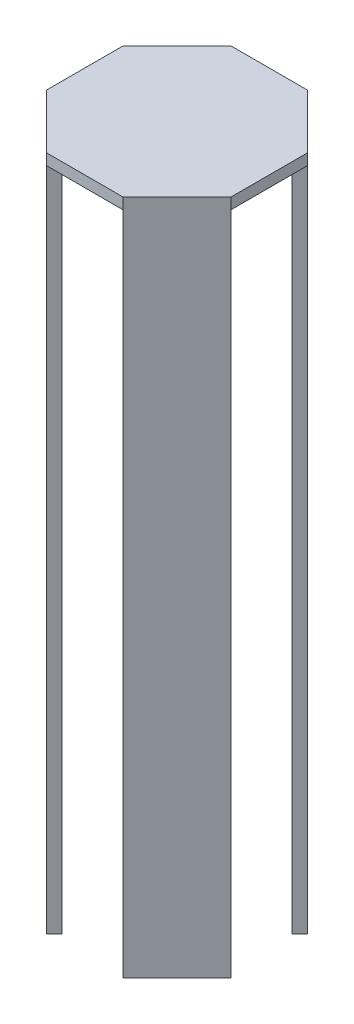
ISO-10303-21;
HEADER;
FILE_DESCRIPTION(('STEP AP214'),'2;1');
FILE_NAME('part.step','',(''),(''),'','','');
FILE_SCHEMA(('AUTOMOTIVE_DESIGN { 1 0 10303 214 1 1 1 1 }'));
ENDSEC;
DATA;
#1=APPLICATION_CONTEXT('core data for automotive mechanical design processes');
#2=APPLICATION_PROTOCOL_DEFINITION('international standard','automotive_design',2000,#1);
#3=PRODUCT_CONTEXT('',#1,'mechanical');
#4=PRODUCT('Part','Part','',(#3));
#5=PRODUCT_RELATED_PRODUCT_CATEGORY('part','',(#4));
#6=PRODUCT_DEFINITION_FORMATION('','',#4);
#7=PRODUCT_DEFINITION_CONTEXT('part definition',#1,'design');
#8=PRODUCT_DEFINITION('design','',#6,#7);
#9=PRODUCT_DEFINITION_SHAPE('','',#8);
#10=(LENGTH_UNIT() NAMED_UNIT(*) SI_UNIT(.MILLI.,.METRE.));
#11=(NAMED_UNIT(*) PLANE_ANGLE_UNIT() SI_UNIT($,.RADIAN.));
#12=(NAMED_UNIT(*) SI_UNIT($,.STERADIAN.) SOLID_ANGLE_UNIT());
#13=UNCERTAINTY_MEASURE_WITH_UNIT(LENGTH_MEASURE(1.E-05),#10,'distance_accuracy_value','');
#14=(GEOMETRIC_REPRESENTATION_CONTEXT(3) GLOBAL_UNCERTAINTY_ASSIGNED_CONTEXT((#13)) GLOBAL_UNIT_ASSIGNED_CONTEXT((#10,
#11,#12)) REPRESENTATION_CONTEXT('',''));
#15=CARTESIAN_POINT('',(0.,0.,0.));
#16=DIRECTION('',(0.,0.,1.));
#17=DIRECTION('',(1.,0.,0.));
#18=AXIS2_PLACEMENT_3D('',#15,#16,#17);
#19=CARTESIAN_POINT('',(0.,180.,0.));
#20=DIRECTION('',(0.,-1.,0.));
#21=DIRECTION('',(0.,0.,-1.));
#22=AXIS2_PLACEMENT_3D('',#19,#20,#21);
#23=PLANE('',#22);
#24=DIRECTION('',(-0.707106781186541,0.,-0.707106781186554));
#25=VECTOR('',#24,1.);
#26=CARTESIAN_POINT('',(-22.8786796564405,180.,8.23401871576749));
#27=LINE('',#26,#25);
#28=CARTESIAN_POINT('',(-8.23401871576796,180.,22.8786796564403));
#29=VERTEX_POINT('',#28);
#30=CARTESIAN_POINT('',(-22.8786796564405,180.,8.23401871576749));
#31=VERTEX_POINT('',#30);
#32=EDGE_CURVE('E193',#29,#31,#27,.T.);
#33=ORIENTED_EDGE('',*,*,#32,.T.);
#34=DIRECTION('',(-0.707106781186554,0.,0.707106781186541));
#35=VECTOR('',#34,1.);
#36=CARTESIAN_POINT('',(-25.0000000000001,180.,10.3553390593271));
#37=LINE('',#36,#35);
#38=CARTESIAN_POINT('',(-25.0000000000001,180.,10.3553390593271));
#39=VERTEX_POINT('',#38);
#40=EDGE_CURVE('E181',#31,#39,#37,.T.);
#41=ORIENTED_EDGE('',*,*,#40,.T.);
#42=DIRECTION('',(0.,0.,1.));
#43=VECTOR('',#42,1.);
#44=CARTESIAN_POINT('',(-25.0000000000001,180.,10.3553390593271));
#45=LINE('',#44,#43);
#46=CARTESIAN_POINT('',(-25.,180.,-10.3553390593274));
#47=VERTEX_POINT('',#46);
#48=EDGE_CURVE('E277',#47,#39,#45,.T.);
#49=ORIENTED_EDGE('',*,*,#48,.F.);
#50=DIRECTION('',(0.707106781186548,0.,0.707106781186547));
#51=VECTOR('',#50,1.);
#52=CARTESIAN_POINT('',(-22.8786796564404,180.,-8.23401871576772));
#53=LINE('',#52,#51);
#54=CARTESIAN_POINT('',(-22.8786796564404,180.,-8.23401871576772));
#55=VERTEX_POINT('',#54);
#56=EDGE_CURVE('E334',#47,#55,#53,.T.);
#57=ORIENTED_EDGE('',*,*,#56,.T.);
#58=DIRECTION('',(0.707106781186547,0.,-0.707106781186548));
#59=VECTOR('',#58,1.);
#60=CARTESIAN_POINT('',(-8.23401871576773,180.,-22.8786796564404));
#61=LINE('',#60,#59);
#62=CARTESIAN_POINT('',(-8.23401871576773,180.,-22.8786796564404));
#63=VERTEX_POINT('',#62);
#64=EDGE_CURVE('E330',#55,#63,#61,.T.);
#65=ORIENTED_EDGE('',*,*,#64,.T.);
#66=DIRECTION('',(-0.707106781186548,0.,-0.707106781186547));
#67=VECTOR('',#66,1.);
#68=CARTESIAN_POINT('',(-10.3553390593274,180.,-25.));
#69=LINE('',#68,#67);
#70=CARTESIAN_POINT('',(-10.3553390593274,180.,-25.));
#71=VERTEX_POINT('',#70);
#72=EDGE_CURVE('E81',#63,#71,#69,.T.);
#73=ORIENTED_EDGE('',*,*,#72,.T.);
#74=DIRECTION('',(-1.,0.,0.));
#75=VECTOR('',#74,1.);
#76=CARTESIAN_POINT('',(-10.3553390593274,180.,-25.));
#77=LINE('',#76,#75);
#78=CARTESIAN_POINT('',(10.3553390593274,180.,-25.));
#79=VERTEX_POINT('',#78);
#80=EDGE_CURVE('E282',#79,#71,#77,.T.);
#81=ORIENTED_EDGE('',*,*,#80,.F.);
#82=DIRECTION('',(-0.707106781186549,0.,0.707106781186546));
#83=VECTOR('',#82,1.);
#84=CARTESIAN_POINT('',(8.2340187157678,180.,-22.8786796564403));
#85=LINE('',#84,#83);
#86=CARTESIAN_POINT('',(8.2340187157678,180.,-22.8786796564403));
#87=VERTEX_POINT('',#86);
#88=EDGE_CURVE('E256',#79,#87,#85,.T.);
#89=ORIENTED_EDGE('',*,*,#88,.T.);
#90=DIRECTION('',(0.707106781186546,0.,0.707106781186549));
#91=VECTOR('',#90,1.);
#92=CARTESIAN_POINT('',(22.8786796564404,180.,-8.23401871576765));
#93=LINE('',#92,#91);
#94=CARTESIAN_POINT('',(22.8786796564404,180.,-8.23401871576765));
#95=VERTEX_POINT('',#94);
#96=EDGE_CURVE('E47',#87,#95,#93,.T.);
#97=ORIENTED_EDGE('',*,*,#96,.T.);
#98=DIRECTION('',(0.70710678118655,0.,-0.707106781186545));
#99=VECTOR('',#98,1.);
#100=CARTESIAN_POINT('',(25.0000000000001,180.,-10.3553390593273));
#101=LINE('',#100,#99);
#102=CARTESIAN_POINT('',(25.0000000000001,180.,-10.3553390593273));
#103=VERTEX_POINT('',#102);
#104=EDGE_CURVE('E252',#95,#103,#101,.T.);
#105=ORIENTED_EDGE('',*,*,#104,.T.);
#106=DIRECTION('',(0.,0.,-1.));
#107=VECTOR('',#106,1.);
#108=CARTESIAN_POINT('',(25.0000000000001,180.,-10.3553390593273));
#109=LINE('',#108,#107);
#110=CARTESIAN_POINT('',(24.9999999999999,180.,10.3553390593275));
#111=VERTEX_POINT('',#110);
#112=EDGE_CURVE('E301',#111,#103,#109,.T.);
#113=ORIENTED_EDGE('',*,*,#112,.F.);
#114=DIRECTION('',(-0.707106781186544,0.,-0.707106781186552));
#115=VECTOR('',#114,1.);
#116=CARTESIAN_POINT('',(22.8786796564403,180.,8.23401871576788));
#117=LINE('',#116,#115);
#118=CARTESIAN_POINT('',(22.8786796564403,180.,8.23401871576788));
#119=VERTEX_POINT('',#118);
#120=EDGE_CURVE('E228',#111,#119,#117,.T.);
#121=ORIENTED_EDGE('',*,*,#120,.T.);
#122=DIRECTION('',(-0.707106781186551,0.,0.707106781186543));
#123=VECTOR('',#122,1.);
#124=CARTESIAN_POINT('',(8.23401871576757,180.,22.8786796564404));
#125=LINE('',#124,#123);
#126=CARTESIAN_POINT('',(8.23401871576757,180.,22.8786796564404));
#127=VERTEX_POINT('',#126);
#128=EDGE_CURVE('E221',#119,#127,#125,.T.);
#129=ORIENTED_EDGE('',*,*,#128,.T.);
#130=DIRECTION('',(0.707106781186543,0.,0.707106781186552));
#131=VECTOR('',#130,1.);
#132=CARTESIAN_POINT('',(10.3553390593272,180.,25.0000000000001));
#133=LINE('',#132,#131);
#134=CARTESIAN_POINT('',(10.3553390593272,180.,25.0000000000001));
#135=VERTEX_POINT('',#134);
#136=EDGE_CURVE('E224',#127,#135,#133,.T.);
#137=ORIENTED_EDGE('',*,*,#136,.T.);
#138=DIRECTION('',(1.,0.,0.));
#139=VECTOR('',#138,1.);
#140=CARTESIAN_POINT('',(10.3553390593272,180.,25.0000000000001));
#141=LINE('',#140,#139);
#142=CARTESIAN_POINT('',(-10.3553390593276,180.,24.9999999999999));
#143=VERTEX_POINT('',#142);
#144=EDGE_CURVE('E298',#143,#135,#141,.T.);
#145=ORIENTED_EDGE('',*,*,#144,.F.);
#146=DIRECTION('',(0.707106781186554,0.,-0.707106781186541));
#147=VECTOR('',#146,1.);
#148=CARTESIAN_POINT('',(-8.23401871576796,180.,22.8786796564403));
#149=LINE('',#148,#147);
#150=EDGE_CURVE('E192',#143,#29,#149,.T.);
#151=ORIENTED_EDGE('',*,*,#150,.T.);
#152=EDGE_LOOP('',(#33,#41,#49,#57,#65,#73,#81,#89,#97,#105,#113,#121,#129,#137,#145,#151));
#153=FACE_BOUND('',#152,.T.);
#154=ADVANCED_FACE('F32',(#153),#23,.T.);
#155=CARTESIAN_POINT('',(-8.23401871576773,180.,-22.8786796564404));
#156=DIRECTION('',(-0.707106781186548,0.,-0.707106781186547));
#157=DIRECTION('',(-0.707106781186547,0.,0.707106781186548));
#158=AXIS2_PLACEMENT_3D('',#155,#156,#157);
#159=PLANE('',#158);
#160=DIRECTION('',(0.707106781186547,0.,-0.707106781186548));
#161=VECTOR('',#160,1.);
#162=CARTESIAN_POINT('',(-8.23401871576773,0.,-22.8786796564404));
#163=LINE('',#162,#161);
#164=CARTESIAN_POINT('',(-22.8786796564404,0.,-8.23401871576772));
#165=VERTEX_POINT('',#164);
#166=CARTESIAN_POINT('',(-8.23401871576773,0.,-22.8786796564404));
#167=VERTEX_POINT('',#166);
#168=EDGE_CURVE('E329',#165,#167,#163,.T.);
#169=ORIENTED_EDGE('',*,*,#168,.T.);
#170=DIRECTION('',(0.,-1.,0.));
#171=VECTOR('',#170,1.);
#172=CARTESIAN_POINT('',(-8.23401871576773,180.,-22.8786796564404));
#173=LINE('',#172,#171);
#174=EDGE_CURVE('E11',#63,#167,#173,.T.);
#175=ORIENTED_EDGE('',*,*,#174,.F.);
#176=ORIENTED_EDGE('',*,*,#64,.F.);
#177=DIRECTION('',(0.,-1.,0.));
#178=VECTOR('',#177,1.);
#179=CARTESIAN_POINT('',(-22.8786796564404,180.,-8.23401871576772));
#180=LINE('',#179,#178);
#181=EDGE_CURVE('E337',#55,#165,#180,.T.);
#182=ORIENTED_EDGE('',*,*,#181,.T.);
#183=EDGE_LOOP('',(#169,#175,#176,#182));
#184=FACE_BOUND('',#183,.T.);
#185=ADVANCED_FACE('F34',(#184),#159,.F.);
#186=CARTESIAN_POINT('',(-10.3553390593274,180.,-25.));
#187=DIRECTION('',(-0.707106781186547,0.,0.707106781186548));
#188=DIRECTION('',(0.707106781186548,0.,0.707106781186547));
#189=AXIS2_PLACEMENT_3D('',#186,#187,#188);
#190=PLANE('',#189);
#191=DIRECTION('',(-0.707106781186548,0.,-0.707106781186547));
#192=VECTOR('',#191,1.);
#193=CARTESIAN_POINT('',(-10.3553390593274,0.,-25.));
#194=LINE('',#193,#192);
#195=CARTESIAN_POINT('',(-10.3553390593274,0.,-25.));
#196=VERTEX_POINT('',#195);
#197=EDGE_CURVE('E340',#167,#196,#194,.T.);
#198=ORIENTED_EDGE('',*,*,#197,.T.);
#199=DIRECTION('',(0.,-1.,0.));
#200=VECTOR('',#199,1.);
#201=CARTESIAN_POINT('',(-10.3553390593274,180.,-25.));
#202=LINE('',#201,#200);
#203=EDGE_CURVE('E40',#71,#196,#202,.T.);
#204=ORIENTED_EDGE('',*,*,#203,.F.);
#205=ORIENTED_EDGE('',*,*,#72,.F.);
#206=ORIENTED_EDGE('',*,*,#174,.T.);
#207=EDGE_LOOP('',(#198,#204,#205,#206));
#208=FACE_BOUND('',#207,.T.);
#209=ADVANCED_FACE('F400',(#208),#190,.F.);
#210=CARTESIAN_POINT('',(-25.,180.,-10.3553390593274));
#211=DIRECTION('',(0.707106781186548,0.,0.707106781186547));
#212=DIRECTION('',(0.707106781186547,0.,-0.707106781186548));
#213=AXIS2_PLACEMENT_3D('',#210,#211,#212);
#214=PLANE('',#213);
#215=DIRECTION('',(-0.707106781186547,0.,0.707106781186548));
#216=VECTOR('',#215,1.);
#217=CARTESIAN_POINT('',(-25.,0.,-10.3553390593274));
#218=LINE('',#217,#216);
#219=CARTESIAN_POINT('',(-25.,0.,-10.3553390593274));
#220=VERTEX_POINT('',#219);
#221=EDGE_CURVE('E342',#196,#220,#218,.T.);
#222=ORIENTED_EDGE('',*,*,#221,.T.);
#223=DIRECTION('',(0.,-1.,0.));
#224=VECTOR('',#223,1.);
#225=CARTESIAN_POINT('',(-25.,180.,-10.3553390593274));
#226=LINE('',#225,#224);
#227=EDGE_CURVE('E56',#47,#220,#226,.T.);
#228=ORIENTED_EDGE('',*,*,#227,.F.);
#229=DIRECTION('',(0.,-1.,0.));
#230=VECTOR('',#229,1.);
#231=CARTESIAN_POINT('',(-25.,183.,-10.3553390593274));
#232=LINE('',#231,#230);
#233=CARTESIAN_POINT('',(-25.,183.,-10.3553390593274));
#234=VERTEX_POINT('',#233);
#235=EDGE_CURVE('E326',#234,#47,#232,.T.);
#236=ORIENTED_EDGE('',*,*,#235,.F.);
#237=DIRECTION('',(-0.707106781186547,0.,0.707106781186548));
#238=VECTOR('',#237,1.);
#239=CARTESIAN_POINT('',(-25.,183.,-10.3553390593274));
#240=LINE('',#239,#238);
#241=CARTESIAN_POINT('',(-10.3553390593274,183.,-25.));
#242=VERTEX_POINT('',#241);
#243=EDGE_CURVE('E278',#242,#234,#240,.T.);
#244=ORIENTED_EDGE('',*,*,#243,.F.);
#245=DIRECTION('',(0.,-1.,0.));
#246=VECTOR('',#245,1.);
#247=CARTESIAN_POINT('',(-10.3553390593274,183.,-25.));
#248=LINE('',#247,#246);
#249=EDGE_CURVE('E296',#242,#71,#248,.T.);
#250=ORIENTED_EDGE('',*,*,#249,.T.);
#251=ORIENTED_EDGE('',*,*,#203,.T.);
#252=EDGE_LOOP('',(#222,#228,#236,#244,#250,#251));
#253=FACE_BOUND('',#252,.T.);
#254=ADVANCED_FACE('F348',(#253),#214,.F.);
#255=CARTESIAN_POINT('',(-22.8786796564404,180.,-8.23401871576772));
#256=DIRECTION('',(0.707106781186547,0.,-0.707106781186548));
#257=DIRECTION('',(-0.707106781186548,0.,-0.707106781186547));
#258=AXIS2_PLACEMENT_3D('',#255,#256,#257);
#259=PLANE('',#258);
#260=DIRECTION('',(0.707106781186548,0.,0.707106781186547));
#261=VECTOR('',#260,1.);
#262=CARTESIAN_POINT('',(-22.8786796564404,0.,-8.23401871576772));
#263=LINE('',#262,#261);
#264=EDGE_CURVE('E76',#220,#165,#263,.T.);
#265=ORIENTED_EDGE('',*,*,#264,.T.);
#266=ORIENTED_EDGE('',*,*,#181,.F.);
#267=ORIENTED_EDGE('',*,*,#56,.F.);
#268=ORIENTED_EDGE('',*,*,#227,.T.);
#269=EDGE_LOOP('',(#265,#266,#267,#268));
#270=FACE_BOUND('',#269,.T.);
#271=ADVANCED_FACE('F355',(#270),#259,.F.);
#272=CARTESIAN_POINT('',(0.,0.,0.));
#273=DIRECTION('',(0.,-1.,0.));
#274=DIRECTION('',(0.,0.,-1.));
#275=AXIS2_PLACEMENT_3D('',#272,#273,#274);
#276=PLANE('',#275);
#277=ORIENTED_EDGE('',*,*,#168,.F.);
#278=ORIENTED_EDGE('',*,*,#264,.F.);
#279=ORIENTED_EDGE('',*,*,#221,.F.);
#280=ORIENTED_EDGE('',*,*,#197,.F.);
#281=EDGE_LOOP('',(#277,#278,#279,#280));
#282=FACE_BOUND('',#281,.T.);
#283=ADVANCED_FACE('F353',(#282),#276,.T.);
#284=CARTESIAN_POINT('',(-25.0000000000001,183.,10.3553390593271));
#285=DIRECTION('',(1.,0.,0.));
#286=DIRECTION('',(0.,0.,-1.));
#287=AXIS2_PLACEMENT_3D('',#284,#285,#286);
#288=PLANE('',#287);
#289=ORIENTED_EDGE('',*,*,#48,.T.);
#290=DIRECTION('',(0.,-1.,0.));
#291=VECTOR('',#290,1.);
#292=CARTESIAN_POINT('',(-25.0000000000001,183.,10.3553390593271));
#293=LINE('',#292,#291);
#294=CARTESIAN_POINT('',(-25.0000000000001,183.,10.3553390593271));
#295=VERTEX_POINT('',#294);
#296=EDGE_CURVE('E323',#295,#39,#293,.T.);
#297=ORIENTED_EDGE('',*,*,#296,.F.);
#298=DIRECTION('',(0.,0.,1.));
#299=VECTOR('',#298,1.);
#300=CARTESIAN_POINT('',(-25.0000000000001,183.,10.3553390593271));
#301=LINE('',#300,#299);
#302=EDGE_CURVE('E281',#234,#295,#301,.T.);
#303=ORIENTED_EDGE('',*,*,#302,.F.);
#304=ORIENTED_EDGE('',*,*,#235,.T.);
#305=EDGE_LOOP('',(#289,#297,#303,#304));
#306=FACE_BOUND('',#305,.T.);
#307=ADVANCED_FACE('F358',(#306),#288,.F.);
#308=CARTESIAN_POINT('',(-10.3553390593276,183.,24.9999999999999));
#309=DIRECTION('',(0.707106781186554,0.,-0.707106781186541));
#310=DIRECTION('',(-0.707106781186541,0.,-0.707106781186554));
#311=AXIS2_PLACEMENT_3D('',#308,#309,#310);
#312=PLANE('',#311);
#313=ORIENTED_EDGE('',*,*,#296,.T.);
#314=DIRECTION('',(0.,-1.,0.));
#315=VECTOR('',#314,1.);
#316=CARTESIAN_POINT('',(-25.0000000000001,180.,10.3553390593271));
#317=LINE('',#316,#315);
#318=CARTESIAN_POINT('',(-25.0000000000001,0.,10.3553390593271));
#319=VERTEX_POINT('',#318);
#320=EDGE_CURVE('E187',#39,#319,#317,.T.);
#321=ORIENTED_EDGE('',*,*,#320,.T.);
#322=DIRECTION('',(0.707106781186541,0.,0.707106781186554));
#323=VECTOR('',#322,1.);
#324=CARTESIAN_POINT('',(-10.3553390593276,0.,24.9999999999999));
#325=LINE('',#324,#323);
#326=CARTESIAN_POINT('',(-10.3553390593276,0.,24.9999999999999));
#327=VERTEX_POINT('',#326);
#328=EDGE_CURVE('E207',#319,#327,#325,.T.);
#329=ORIENTED_EDGE('',*,*,#328,.T.);
#330=DIRECTION('',(0.,-1.,0.));
#331=VECTOR('',#330,1.);
#332=CARTESIAN_POINT('',(-10.3553390593276,180.,24.9999999999999));
#333=LINE('',#332,#331);
#334=EDGE_CURVE('E217',#143,#327,#333,.T.);
#335=ORIENTED_EDGE('',*,*,#334,.F.);
#336=DIRECTION('',(0.,-1.,0.));
#337=VECTOR('',#336,1.);
#338=CARTESIAN_POINT('',(-10.3553390593276,183.,24.9999999999999));
#339=LINE('',#338,#337);
#340=CARTESIAN_POINT('',(-10.3553390593276,183.,24.9999999999999));
#341=VERTEX_POINT('',#340);
#342=EDGE_CURVE('E320',#341,#143,#339,.T.);
#343=ORIENTED_EDGE('',*,*,#342,.F.);
#344=DIRECTION('',(0.707106781186541,0.,0.707106781186554));
#345=VECTOR('',#344,1.);
#346=CARTESIAN_POINT('',(-10.3553390593276,183.,24.9999999999999));
#347=LINE('',#346,#345);
#348=EDGE_CURVE('E284',#295,#341,#347,.T.);
#349=ORIENTED_EDGE('',*,*,#348,.F.);
#350=EDGE_LOOP('',(#313,#321,#329,#335,#343,#349));
#351=FACE_BOUND('',#350,.T.);
#352=ADVANCED_FACE('F444',(#351),#312,.F.);
#353=CARTESIAN_POINT('',(10.3553390593272,183.,25.0000000000001));
#354=DIRECTION('',(0.,0.,-1.));
#355=DIRECTION('',(-1.,0.,0.));
#356=AXIS2_PLACEMENT_3D('',#353,#354,#355);
#357=PLANE('',#356);
#358=ORIENTED_EDGE('',*,*,#144,.T.);
#359=DIRECTION('',(0.,-1.,0.));
#360=VECTOR('',#359,1.);
#361=CARTESIAN_POINT('',(10.3553390593272,183.,25.0000000000001));
#362=LINE('',#361,#360);
#363=CARTESIAN_POINT('',(10.3553390593272,183.,25.0000000000001));
#364=VERTEX_POINT('',#363);
#365=EDGE_CURVE('E317',#364,#135,#362,.T.);
#366=ORIENTED_EDGE('',*,*,#365,.F.);
#367=DIRECTION('',(1.,0.,0.));
#368=VECTOR('',#367,1.);
#369=CARTESIAN_POINT('',(10.3553390593272,183.,25.0000000000001));
#370=LINE('',#369,#368);
#371=EDGE_CURVE('E286',#341,#364,#370,.T.);
#372=ORIENTED_EDGE('',*,*,#371,.F.);
#373=ORIENTED_EDGE('',*,*,#342,.T.);
#374=EDGE_LOOP('',(#358,#366,#372,#373));
#375=FACE_BOUND('',#374,.T.);
#376=ADVANCED_FACE('F452',(#375),#357,.F.);
#377=CARTESIAN_POINT('',(24.9999999999999,183.,10.3553390593275));
#378=DIRECTION('',(-0.707106781186543,0.,-0.707106781186552));
#379=DIRECTION('',(-0.707106781186552,0.,0.707106781186543));
#380=AXIS2_PLACEMENT_3D('',#377,#378,#379);
#381=PLANE('',#380);
#382=ORIENTED_EDGE('',*,*,#365,.T.);
#383=DIRECTION('',(0.,-1.,0.));
#384=VECTOR('',#383,1.);
#385=CARTESIAN_POINT('',(10.3553390593272,180.,25.0000000000001));
#386=LINE('',#385,#384);
#387=CARTESIAN_POINT('',(10.3553390593272,0.,25.0000000000001));
#388=VERTEX_POINT('',#387);
#389=EDGE_CURVE('E244',#135,#388,#386,.T.);
#390=ORIENTED_EDGE('',*,*,#389,.T.);
#391=DIRECTION('',(0.707106781186552,0.,-0.707106781186543));
#392=VECTOR('',#391,1.);
#393=CARTESIAN_POINT('',(24.9999999999999,0.,10.3553390593275));
#394=LINE('',#393,#392);
#395=CARTESIAN_POINT('',(24.9999999999999,0.,10.3553390593275));
#396=VERTEX_POINT('',#395);
#397=EDGE_CURVE('E236',#388,#396,#394,.T.);
#398=ORIENTED_EDGE('',*,*,#397,.T.);
#399=DIRECTION('',(0.,-1.,0.));
#400=VECTOR('',#399,1.);
#401=CARTESIAN_POINT('',(24.9999999999999,180.,10.3553390593275));
#402=LINE('',#401,#400);
#403=EDGE_CURVE('E241',#111,#396,#402,.T.);
#404=ORIENTED_EDGE('',*,*,#403,.F.);
#405=DIRECTION('',(0.,-1.,0.));
#406=VECTOR('',#405,1.);
#407=CARTESIAN_POINT('',(24.9999999999999,183.,10.3553390593275));
#408=LINE('',#407,#406);
#409=CARTESIAN_POINT('',(24.9999999999999,183.,10.3553390593275));
#410=VERTEX_POINT('',#409);
#411=EDGE_CURVE('E314',#410,#111,#408,.T.);
#412=ORIENTED_EDGE('',*,*,#411,.F.);
#413=DIRECTION('',(0.707106781186552,0.,-0.707106781186543));
#414=VECTOR('',#413,1.);
#415=CARTESIAN_POINT('',(24.9999999999999,183.,10.3553390593275));
#416=LINE('',#415,#414);
#417=EDGE_CURVE('E288',#364,#410,#416,.T.);
#418=ORIENTED_EDGE('',*,*,#417,.F.);
#419=EDGE_LOOP('',(#382,#390,#398,#404,#412,#418));
#420=FACE_BOUND('',#419,.T.);
#421=ADVANCED_FACE('F393',(#420),#381,.F.);
#422=CARTESIAN_POINT('',(25.0000000000001,183.,-10.3553390593273));
#423=DIRECTION('',(-1.,0.,0.));
#424=DIRECTION('',(0.,0.,1.));
#425=AXIS2_PLACEMENT_3D('',#422,#423,#424);
#426=PLANE('',#425);
#427=ORIENTED_EDGE('',*,*,#112,.T.);
#428=DIRECTION('',(0.,-1.,0.));
#429=VECTOR('',#428,1.);
#430=CARTESIAN_POINT('',(25.0000000000001,183.,-10.3553390593273));
#431=LINE('',#430,#429);
#432=CARTESIAN_POINT('',(25.0000000000001,183.,-10.3553390593273));
#433=VERTEX_POINT('',#432);
#434=EDGE_CURVE('E311',#433,#103,#431,.T.);
#435=ORIENTED_EDGE('',*,*,#434,.F.);
#436=DIRECTION('',(0.,0.,-1.));
#437=VECTOR('',#436,1.);
#438=CARTESIAN_POINT('',(25.0000000000001,183.,-10.3553390593273));
#439=LINE('',#438,#437);
#440=EDGE_CURVE('E290',#410,#433,#439,.T.);
#441=ORIENTED_EDGE('',*,*,#440,.F.);
#442=ORIENTED_EDGE('',*,*,#411,.T.);
#443=EDGE_LOOP('',(#427,#435,#441,#442));
#444=FACE_BOUND('',#443,.T.);
#445=ADVANCED_FACE('F381',(#444),#426,.F.);
#446=CARTESIAN_POINT('',(10.3553390593274,183.,-25.));
#447=DIRECTION('',(-0.707106781186549,0.,0.707106781186546));
#448=DIRECTION('',(0.707106781186546,0.,0.707106781186549));
#449=AXIS2_PLACEMENT_3D('',#446,#447,#448);
#450=PLANE('',#449);
#451=ORIENTED_EDGE('',*,*,#434,.T.);
#452=DIRECTION('',(0.,-1.,0.));
#453=VECTOR('',#452,1.);
#454=CARTESIAN_POINT('',(25.0000000000001,180.,-10.3553390593273));
#455=LINE('',#454,#453);
#456=CARTESIAN_POINT('',(25.0000000000001,0.,-10.3553390593273));
#457=VERTEX_POINT('',#456);
#458=EDGE_CURVE('E271',#103,#457,#455,.T.);
#459=ORIENTED_EDGE('',*,*,#458,.T.);
#460=DIRECTION('',(-0.707106781186546,0.,-0.707106781186549));
#461=VECTOR('',#460,1.);
#462=CARTESIAN_POINT('',(10.3553390593274,0.,-25.));
#463=LINE('',#462,#461);
#464=CARTESIAN_POINT('',(10.3553390593274,0.,-25.));
#465=VERTEX_POINT('',#464);
#466=EDGE_CURVE('E264',#457,#465,#463,.T.);
#467=ORIENTED_EDGE('',*,*,#466,.T.);
#468=DIRECTION('',(0.,-1.,0.));
#469=VECTOR('',#468,1.);
#470=CARTESIAN_POINT('',(10.3553390593274,180.,-25.));
#471=LINE('',#470,#469);
#472=EDGE_CURVE('E268',#79,#465,#471,.T.);
#473=ORIENTED_EDGE('',*,*,#472,.F.);
#474=DIRECTION('',(0.,-1.,0.));
#475=VECTOR('',#474,1.);
#476=CARTESIAN_POINT('',(10.3553390593274,183.,-25.));
#477=LINE('',#476,#475);
#478=CARTESIAN_POINT('',(10.3553390593274,183.,-25.));
#479=VERTEX_POINT('',#478);
#480=EDGE_CURVE('E308',#479,#79,#477,.T.);
#481=ORIENTED_EDGE('',*,*,#480,.F.);
#482=DIRECTION('',(-0.707106781186546,0.,-0.707106781186549));
#483=VECTOR('',#482,1.);
#484=CARTESIAN_POINT('',(10.3553390593274,183.,-25.));
#485=LINE('',#484,#483);
#486=EDGE_CURVE('E292',#433,#479,#485,.T.);
#487=ORIENTED_EDGE('',*,*,#486,.F.);
#488=EDGE_LOOP('',(#451,#459,#467,#473,#481,#487));
#489=FACE_BOUND('',#488,.T.);
#490=ADVANCED_FACE('F385',(#489),#450,.F.);
#491=CARTESIAN_POINT('',(-10.3553390593274,183.,-25.));
#492=DIRECTION('',(0.,0.,1.));
#493=DIRECTION('',(1.,0.,0.));
#494=AXIS2_PLACEMENT_3D('',#491,#492,#493);
#495=PLANE('',#494);
#496=ORIENTED_EDGE('',*,*,#80,.T.);
#497=ORIENTED_EDGE('',*,*,#249,.F.);
#498=DIRECTION('',(-1.,0.,0.));
#499=VECTOR('',#498,1.);
#500=CARTESIAN_POINT('',(-10.3553390593274,183.,-25.));
#501=LINE('',#500,#499);
#502=EDGE_CURVE('E294',#479,#242,#501,.T.);
#503=ORIENTED_EDGE('',*,*,#502,.F.);
#504=ORIENTED_EDGE('',*,*,#480,.T.);
#505=EDGE_LOOP('',(#496,#497,#503,#504));
#506=FACE_BOUND('',#505,.T.);
#507=ADVANCED_FACE('F365',(#506),#495,.F.);
#508=CARTESIAN_POINT('',(0.,183.,0.));
#509=DIRECTION('',(0.,-1.,0.));
#510=DIRECTION('',(0.,0.,-1.));
#511=AXIS2_PLACEMENT_3D('',#508,#509,#510);
#512=PLANE('',#511);
#513=ORIENTED_EDGE('',*,*,#243,.T.);
#514=ORIENTED_EDGE('',*,*,#302,.T.);
#515=ORIENTED_EDGE('',*,*,#348,.T.);
#516=ORIENTED_EDGE('',*,*,#371,.T.);
#517=ORIENTED_EDGE('',*,*,#417,.T.);
#518=ORIENTED_EDGE('',*,*,#440,.T.);
#519=ORIENTED_EDGE('',*,*,#486,.T.);
#520=ORIENTED_EDGE('',*,*,#502,.T.);
#521=EDGE_LOOP('',(#513,#514,#515,#516,#517,#518,#519,#520));
#522=FACE_BOUND('',#521,.T.);
#523=ADVANCED_FACE('F360',(#522),#512,.F.);
#524=CARTESIAN_POINT('',(22.8786796564404,180.,-8.23401871576765));
#525=DIRECTION('',(0.707106781186549,0.,-0.707106781186546));
#526=DIRECTION('',(-0.707106781186546,0.,-0.707106781186549));
#527=AXIS2_PLACEMENT_3D('',#524,#525,#526);
#528=PLANE('',#527);
#529=DIRECTION('',(0.707106781186546,0.,0.707106781186549));
#530=VECTOR('',#529,1.);
#531=CARTESIAN_POINT('',(22.8786796564404,0.,-8.23401871576765));
#532=LINE('',#531,#530);
#533=CARTESIAN_POINT('',(8.2340187157678,0.,-22.8786796564403));
#534=VERTEX_POINT('',#533);
#535=CARTESIAN_POINT('',(22.8786796564404,0.,-8.23401871576765));
#536=VERTEX_POINT('',#535);
#537=EDGE_CURVE('E250',#534,#536,#532,.T.);
#538=ORIENTED_EDGE('',*,*,#537,.T.);
#539=DIRECTION('',(0.,-1.,0.));
#540=VECTOR('',#539,1.);
#541=CARTESIAN_POINT('',(22.8786796564404,180.,-8.23401871576765));
#542=LINE('',#541,#540);
#543=EDGE_CURVE('E274',#95,#536,#542,.T.);
#544=ORIENTED_EDGE('',*,*,#543,.F.);
#545=ORIENTED_EDGE('',*,*,#96,.F.);
#546=DIRECTION('',(0.,-1.,0.));
#547=VECTOR('',#546,1.);
#548=CARTESIAN_POINT('',(8.2340187157678,180.,-22.8786796564403));
#549=LINE('',#548,#547);
#550=EDGE_CURVE('E259',#87,#534,#549,.T.);
#551=ORIENTED_EDGE('',*,*,#550,.T.);
#552=EDGE_LOOP('',(#538,#544,#545,#551));
#553=FACE_BOUND('',#552,.T.);
#554=ADVANCED_FACE('F372',(#553),#528,.F.);
#555=CARTESIAN_POINT('',(25.0000000000001,180.,-10.3553390593273));
#556=DIRECTION('',(-0.707106781186545,0.,-0.70710678118655));
#557=DIRECTION('',(-0.70710678118655,0.,0.707106781186545));
#558=AXIS2_PLACEMENT_3D('',#555,#556,#557);
#559=PLANE('',#558);
#560=DIRECTION('',(0.70710678118655,0.,-0.707106781186545));
#561=VECTOR('',#560,1.);
#562=CARTESIAN_POINT('',(25.0000000000001,0.,-10.3553390593273));
#563=LINE('',#562,#561);
#564=EDGE_CURVE('E262',#536,#457,#563,.T.);
#565=ORIENTED_EDGE('',*,*,#564,.T.);
#566=ORIENTED_EDGE('',*,*,#458,.F.);
#567=ORIENTED_EDGE('',*,*,#104,.F.);
#568=ORIENTED_EDGE('',*,*,#543,.T.);
#569=EDGE_LOOP('',(#565,#566,#567,#568));
#570=FACE_BOUND('',#569,.T.);
#571=ADVANCED_FACE('F377',(#570),#559,.F.);
#572=CARTESIAN_POINT('',(8.2340187157678,180.,-22.8786796564403));
#573=DIRECTION('',(0.707106781186546,0.,0.707106781186549));
#574=DIRECTION('',(0.707106781186549,0.,-0.707106781186546));
#575=AXIS2_PLACEMENT_3D('',#572,#573,#574);
#576=PLANE('',#575);
#577=DIRECTION('',(-0.707106781186549,0.,0.707106781186546));
#578=VECTOR('',#577,1.);
#579=CARTESIAN_POINT('',(8.2340187157678,0.,-22.8786796564403));
#580=LINE('',#579,#578);
#581=EDGE_CURVE('E253',#465,#534,#580,.T.);
#582=ORIENTED_EDGE('',*,*,#581,.T.);
#583=ORIENTED_EDGE('',*,*,#550,.F.);
#584=ORIENTED_EDGE('',*,*,#88,.F.);
#585=ORIENTED_EDGE('',*,*,#472,.T.);
#586=EDGE_LOOP('',(#582,#583,#584,#585));
#587=FACE_BOUND('',#586,.T.);
#588=ADVANCED_FACE('F369',(#587),#576,.F.);
#589=CARTESIAN_POINT('',(0.,0.,0.));
#590=DIRECTION('',(0.,-1.,0.));
#591=DIRECTION('',(0.,0.,-1.));
#592=AXIS2_PLACEMENT_3D('',#589,#590,#591);
#593=PLANE('',#592);
#594=ORIENTED_EDGE('',*,*,#537,.F.);
#595=ORIENTED_EDGE('',*,*,#581,.F.);
#596=ORIENTED_EDGE('',*,*,#466,.F.);
#597=ORIENTED_EDGE('',*,*,#564,.F.);
#598=EDGE_LOOP('',(#594,#595,#596,#597));
#599=FACE_BOUND('',#598,.T.);
#600=ADVANCED_FACE('F374',(#599),#593,.T.);
#601=CARTESIAN_POINT('',(8.23401871576757,180.,22.8786796564404));
#602=DIRECTION('',(0.707106781186543,0.,0.707106781186551));
#603=DIRECTION('',(0.707106781186552,0.,-0.707106781186544));
#604=AXIS2_PLACEMENT_3D('',#601,#602,#603);
#605=PLANE('',#604);
#606=DIRECTION('',(-0.707106781186551,0.,0.707106781186543));
#607=VECTOR('',#606,1.);
#608=CARTESIAN_POINT('',(8.23401871576757,0.,22.8786796564404));
#609=LINE('',#608,#607);
#610=CARTESIAN_POINT('',(22.8786796564403,0.,8.23401871576788));
#611=VERTEX_POINT('',#610);
#612=CARTESIAN_POINT('',(8.23401871576757,0.,22.8786796564404));
#613=VERTEX_POINT('',#612);
#614=EDGE_CURVE('E202',#611,#613,#609,.T.);
#615=ORIENTED_EDGE('',*,*,#614,.T.);
#616=DIRECTION('',(0.,-1.,0.));
#617=VECTOR('',#616,1.);
#618=CARTESIAN_POINT('',(8.23401871576757,180.,22.8786796564404));
#619=LINE('',#618,#617);
#620=EDGE_CURVE('E247',#127,#613,#619,.T.);
#621=ORIENTED_EDGE('',*,*,#620,.F.);
#622=ORIENTED_EDGE('',*,*,#128,.F.);
#623=DIRECTION('',(0.,-1.,0.));
#624=VECTOR('',#623,1.);
#625=CARTESIAN_POINT('',(22.8786796564403,180.,8.23401871576788));
#626=LINE('',#625,#624);
#627=EDGE_CURVE('E231',#119,#611,#626,.T.);
#628=ORIENTED_EDGE('',*,*,#627,.T.);
#629=EDGE_LOOP('',(#615,#621,#622,#628));
#630=FACE_BOUND('',#629,.T.);
#631=ADVANCED_FACE('F412',(#630),#605,.F.);
#632=CARTESIAN_POINT('',(10.3553390593272,180.,25.0000000000001));
#633=DIRECTION('',(0.707106781186552,0.,-0.707106781186543));
#634=DIRECTION('',(-0.707106781186543,0.,-0.707106781186552));
#635=AXIS2_PLACEMENT_3D('',#632,#633,#634);
#636=PLANE('',#635);
#637=DIRECTION('',(0.707106781186543,0.,0.707106781186552));
#638=VECTOR('',#637,1.);
#639=CARTESIAN_POINT('',(10.3553390593272,0.,25.0000000000001));
#640=LINE('',#639,#638);
#641=EDGE_CURVE('E234',#613,#388,#640,.T.);
#642=ORIENTED_EDGE('',*,*,#641,.T.);
#643=ORIENTED_EDGE('',*,*,#389,.F.);
#644=ORIENTED_EDGE('',*,*,#136,.F.);
#645=ORIENTED_EDGE('',*,*,#620,.T.);
#646=EDGE_LOOP('',(#642,#643,#644,#645));
#647=FACE_BOUND('',#646,.T.);
#648=ADVANCED_FACE('F415',(#647),#636,.F.);
#649=CARTESIAN_POINT('',(22.8786796564403,180.,8.23401871576788));
#650=DIRECTION('',(-0.707106781186551,0.,0.707106781186543));
#651=DIRECTION('',(0.707106781186543,0.,0.707106781186552));
#652=AXIS2_PLACEMENT_3D('',#649,#650,#651);
#653=PLANE('',#652);
#654=DIRECTION('',(-0.707106781186544,0.,-0.707106781186552));
#655=VECTOR('',#654,1.);
#656=CARTESIAN_POINT('',(22.8786796564403,0.,8.23401871576788));
#657=LINE('',#656,#655);
#658=EDGE_CURVE('E225',#396,#611,#657,.T.);
#659=ORIENTED_EDGE('',*,*,#658,.T.);
#660=ORIENTED_EDGE('',*,*,#627,.F.);
#661=ORIENTED_EDGE('',*,*,#120,.F.);
#662=ORIENTED_EDGE('',*,*,#403,.T.);
#663=EDGE_LOOP('',(#659,#660,#661,#662));
#664=FACE_BOUND('',#663,.T.);
#665=ADVANCED_FACE('F419',(#664),#653,.F.);
#666=CARTESIAN_POINT('',(0.,0.,0.));
#667=DIRECTION('',(0.,-1.,0.));
#668=DIRECTION('',(0.,0.,-1.));
#669=AXIS2_PLACEMENT_3D('',#666,#667,#668);
#670=PLANE('',#669);
#671=ORIENTED_EDGE('',*,*,#614,.F.);
#672=ORIENTED_EDGE('',*,*,#658,.F.);
#673=ORIENTED_EDGE('',*,*,#397,.F.);
#674=ORIENTED_EDGE('',*,*,#641,.F.);
#675=EDGE_LOOP('',(#671,#672,#673,#674));
#676=FACE_BOUND('',#675,.T.);
#677=ADVANCED_FACE('F423',(#676),#670,.T.);
#678=CARTESIAN_POINT('',(-22.8786796564405,180.,8.23401871576749));
#679=DIRECTION('',(-0.707106781186554,0.,0.707106781186541));
#680=DIRECTION('',(0.707106781186541,0.,0.707106781186554));
#681=AXIS2_PLACEMENT_3D('',#678,#679,#680);
#682=PLANE('',#681);
#683=DIRECTION('',(-0.707106781186541,0.,-0.707106781186554));
#684=VECTOR('',#683,1.);
#685=CARTESIAN_POINT('',(-22.8786796564405,0.,8.23401871576749));
#686=LINE('',#685,#684);
#687=CARTESIAN_POINT('',(-8.23401871576796,0.,22.8786796564403));
#688=VERTEX_POINT('',#687);
#689=CARTESIAN_POINT('',(-22.8786796564405,0.,8.23401871576749));
#690=VERTEX_POINT('',#689);
#691=EDGE_CURVE('E201',#688,#690,#686,.T.);
#692=ORIENTED_EDGE('',*,*,#691,.T.);
#693=DIRECTION('',(0.,-1.,0.));
#694=VECTOR('',#693,1.);
#695=CARTESIAN_POINT('',(-22.8786796564405,180.,8.23401871576749));
#696=LINE('',#695,#694);
#697=EDGE_CURVE('E184',#31,#690,#696,.T.);
#698=ORIENTED_EDGE('',*,*,#697,.F.);
#699=ORIENTED_EDGE('',*,*,#32,.F.);
#700=DIRECTION('',(0.,-1.,0.));
#701=VECTOR('',#700,1.);
#702=CARTESIAN_POINT('',(-8.23401871576796,180.,22.8786796564403));
#703=LINE('',#702,#701);
#704=EDGE_CURVE('E211',#29,#688,#703,.T.);
#705=ORIENTED_EDGE('',*,*,#704,.T.);
#706=EDGE_LOOP('',(#692,#698,#699,#705));
#707=FACE_BOUND('',#706,.T.);
#708=ADVANCED_FACE('F197',(#707),#682,.F.);
#709=CARTESIAN_POINT('',(-25.0000000000001,180.,10.3553390593271));
#710=DIRECTION('',(0.707106781186541,0.,0.707106781186554));
#711=DIRECTION('',(0.707106781186554,0.,-0.707106781186541));
#712=AXIS2_PLACEMENT_3D('',#709,#710,#711);
#713=PLANE('',#712);
#714=DIRECTION('',(-0.707106781186554,0.,0.707106781186541));
#715=VECTOR('',#714,1.);
#716=CARTESIAN_POINT('',(-25.0000000000001,0.,10.3553390593271));
#717=LINE('',#716,#715);
#718=EDGE_CURVE('E213',#690,#319,#717,.T.);
#719=ORIENTED_EDGE('',*,*,#718,.T.);
#720=ORIENTED_EDGE('',*,*,#320,.F.);
#721=ORIENTED_EDGE('',*,*,#40,.F.);
#722=ORIENTED_EDGE('',*,*,#697,.T.);
#723=EDGE_LOOP('',(#719,#720,#721,#722));
#724=FACE_BOUND('',#723,.T.);
#725=ADVANCED_FACE('F183',(#724),#713,.F.);
#726=CARTESIAN_POINT('',(-8.23401871576796,180.,22.8786796564403));
#727=DIRECTION('',(-0.707106781186541,0.,-0.707106781186554));
#728=DIRECTION('',(-0.707106781186554,0.,0.707106781186541));
#729=AXIS2_PLACEMENT_3D('',#726,#727,#728);
#730=PLANE('',#729);
#731=DIRECTION('',(0.707106781186554,0.,-0.707106781186541));
#732=VECTOR('',#731,1.);
#733=CARTESIAN_POINT('',(-8.23401871576796,0.,22.8786796564403));
#734=LINE('',#733,#732);
#735=EDGE_CURVE('E205',#327,#688,#734,.T.);
#736=ORIENTED_EDGE('',*,*,#735,.T.);
#737=ORIENTED_EDGE('',*,*,#704,.F.);
#738=ORIENTED_EDGE('',*,*,#150,.F.);
#739=ORIENTED_EDGE('',*,*,#334,.T.);
#740=EDGE_LOOP('',(#736,#737,#738,#739));
#741=FACE_BOUND('',#740,.T.);
#742=ADVANCED_FACE('F432',(#741),#730,.F.);
#743=CARTESIAN_POINT('',(0.,0.,0.));
#744=DIRECTION('',(0.,-1.,0.));
#745=DIRECTION('',(0.,0.,-1.));
#746=AXIS2_PLACEMENT_3D('',#743,#744,#745);
#747=PLANE('',#746);
#748=ORIENTED_EDGE('',*,*,#691,.F.);
#749=ORIENTED_EDGE('',*,*,#735,.F.);
#750=ORIENTED_EDGE('',*,*,#328,.F.);
#751=ORIENTED_EDGE('',*,*,#718,.F.);
#752=EDGE_LOOP('',(#748,#749,#750,#751));
#753=FACE_BOUND('',#752,.T.);
#754=ADVANCED_FACE('F435',(#753),#747,.T.);
#755=CLOSED_SHELL('',(#154,#185,#209,#254,#271,#283,#307,#352,#376,#421,#445,#490,#507,#523,
#554,#571,#588,#600,#631,#648,#665,#677,#708,#725,#742,#754));
#756=MANIFOLD_SOLID_BREP('B2',#755);
#757=ADVANCED_BREP_SHAPE_REPRESENTATION('',(#18,#756),#14);
#758=SHAPE_DEFINITION_REPRESENTATION(#9,#757);
ENDSEC;
END-ISO-10303-21;
